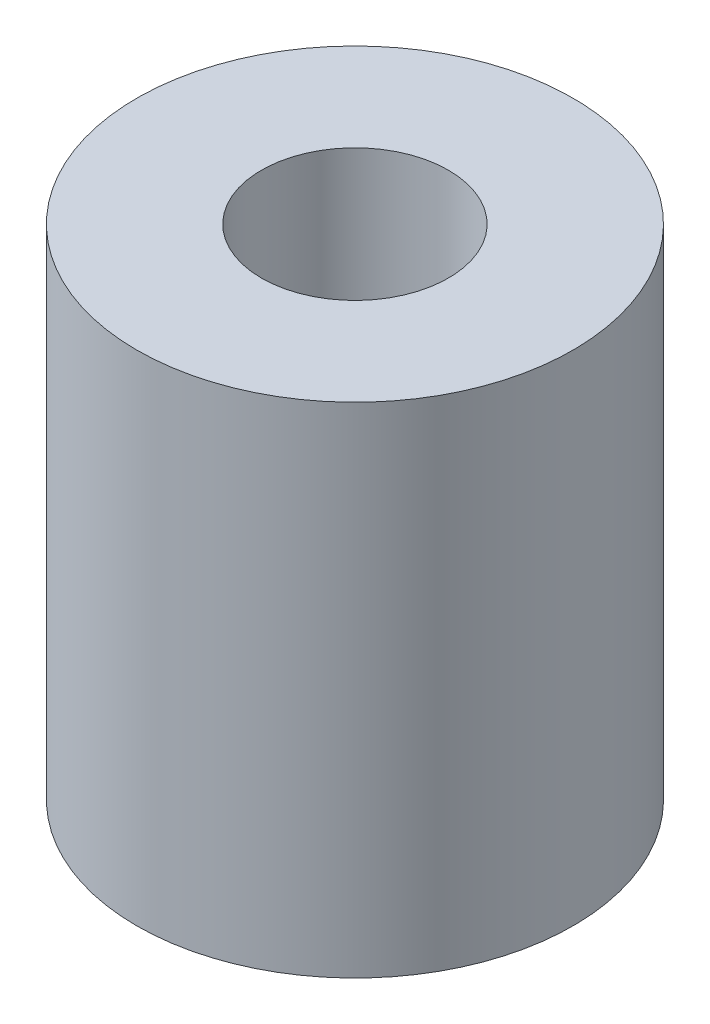
ISO-10303-21;
HEADER;
FILE_DESCRIPTION(('STEP AP214'),'2;1');
FILE_NAME('part.step','',(''),(''),'','','');
FILE_SCHEMA(('AUTOMOTIVE_DESIGN { 1 0 10303 214 1 1 1 1 }'));
ENDSEC;
DATA;
#1=APPLICATION_CONTEXT('core data for automotive mechanical design processes');
#2=APPLICATION_PROTOCOL_DEFINITION('international standard','automotive_design',2000,#1);
#3=PRODUCT_CONTEXT('',#1,'mechanical');
#4=PRODUCT('Part','Part','',(#3));
#5=PRODUCT_RELATED_PRODUCT_CATEGORY('part','',(#4));
#6=PRODUCT_DEFINITION_FORMATION('','',#4);
#7=PRODUCT_DEFINITION_CONTEXT('part definition',#1,'design');
#8=PRODUCT_DEFINITION('design','',#6,#7);
#9=PRODUCT_DEFINITION_SHAPE('','',#8);
#10=(LENGTH_UNIT() NAMED_UNIT(*) SI_UNIT(.MILLI.,.METRE.));
#11=(NAMED_UNIT(*) PLANE_ANGLE_UNIT() SI_UNIT($,.RADIAN.));
#12=(NAMED_UNIT(*) SI_UNIT($,.STERADIAN.) SOLID_ANGLE_UNIT());
#13=UNCERTAINTY_MEASURE_WITH_UNIT(LENGTH_MEASURE(1.E-05),#10,'distance_accuracy_value','');
#14=(GEOMETRIC_REPRESENTATION_CONTEXT(3) GLOBAL_UNCERTAINTY_ASSIGNED_CONTEXT((#13)) GLOBAL_UNIT_ASSIGNED_CONTEXT((#10,
#11,#12)) REPRESENTATION_CONTEXT('',''));
#15=CARTESIAN_POINT('',(0.,0.,0.));
#16=DIRECTION('',(0.,0.,1.));
#17=DIRECTION('',(1.,0.,0.));
#18=AXIS2_PLACEMENT_3D('',#15,#16,#17);
#19=CARTESIAN_POINT('',(0.,8.,0.));
#20=DIRECTION('',(0.,1.,0.));
#21=DIRECTION('',(0.,0.,1.));
#22=AXIS2_PLACEMENT_3D('',#19,#20,#21);
#23=PLANE('',#22);
#24=CARTESIAN_POINT('',(0.,8.,0.));
#25=DIRECTION('',(0.,1.,0.));
#26=DIRECTION('',(0.,0.,1.));
#27=AXIS2_PLACEMENT_3D('',#24,#25,#26);
#28=CIRCLE('',#27,3.5);
#29=CARTESIAN_POINT('',(0.,8.,3.5));
#30=VERTEX_POINT('',#29);
#31=EDGE_CURVE('E10',#30,#30,#28,.T.);
#32=ORIENTED_EDGE('',*,*,#31,.T.);
#33=EDGE_LOOP('',(#32));
#34=FACE_BOUND('',#33,.T.);
#35=CARTESIAN_POINT('',(0.,8.,0.));
#36=DIRECTION('',(0.,1.,0.));
#37=DIRECTION('',(0.,0.,1.));
#38=AXIS2_PLACEMENT_3D('',#35,#36,#37);
#39=CIRCLE('',#38,1.5);
#40=CARTESIAN_POINT('',(0.,8.,1.5));
#41=VERTEX_POINT('',#40);
#42=EDGE_CURVE('E44',#41,#41,#39,.T.);
#43=ORIENTED_EDGE('',*,*,#42,.F.);
#44=EDGE_LOOP('',(#43));
#45=FACE_BOUND('',#44,.T.);
#46=ADVANCED_FACE('F33',(#34,#45),#23,.T.);
#47=CARTESIAN_POINT('',(0.,0.,0.));
#48=DIRECTION('',(0.,1.,0.));
#49=DIRECTION('',(0.,0.,1.));
#50=AXIS2_PLACEMENT_3D('',#47,#48,#49);
#51=PLANE('',#50);
#52=CARTESIAN_POINT('',(0.,0.,0.));
#53=DIRECTION('',(0.,1.,0.));
#54=DIRECTION('',(0.,0.,1.));
#55=AXIS2_PLACEMENT_3D('',#52,#53,#54);
#56=CIRCLE('',#55,3.5);
#57=CARTESIAN_POINT('',(0.,0.,3.5));
#58=VERTEX_POINT('',#57);
#59=EDGE_CURVE('E37',#58,#58,#56,.T.);
#60=ORIENTED_EDGE('',*,*,#59,.F.);
#61=EDGE_LOOP('',(#60));
#62=FACE_BOUND('',#61,.T.);
#63=CARTESIAN_POINT('',(0.,0.,0.));
#64=DIRECTION('',(0.,1.,0.));
#65=DIRECTION('',(0.,0.,1.));
#66=AXIS2_PLACEMENT_3D('',#63,#64,#65);
#67=CIRCLE('',#66,1.5);
#68=CARTESIAN_POINT('',(0.,0.,1.5));
#69=VERTEX_POINT('',#68);
#70=EDGE_CURVE('E46',#69,#69,#67,.T.);
#71=ORIENTED_EDGE('',*,*,#70,.T.);
#72=EDGE_LOOP('',(#71));
#73=FACE_BOUND('',#72,.T.);
#74=ADVANCED_FACE('F56',(#62,#73),#51,.F.);
#75=CARTESIAN_POINT('',(0.,8.,0.));
#76=DIRECTION('',(0.,-1.,0.));
#77=DIRECTION('',(0.,0.,-1.));
#78=AXIS2_PLACEMENT_3D('',#75,#76,#77);
#79=CYLINDRICAL_SURFACE('',#78,3.5);
#80=ORIENTED_EDGE('',*,*,#31,.F.);
#81=EDGE_LOOP('',(#80));
#82=FACE_BOUND('',#81,.T.);
#83=ORIENTED_EDGE('',*,*,#59,.T.);
#84=EDGE_LOOP('',(#83));
#85=FACE_BOUND('',#84,.T.);
#86=ADVANCED_FACE('F35',(#82,#85),#79,.T.);
#87=CARTESIAN_POINT('',(0.,8.,0.));
#88=DIRECTION('',(0.,-1.,0.));
#89=DIRECTION('',(0.,0.,-1.));
#90=AXIS2_PLACEMENT_3D('',#87,#88,#89);
#91=CYLINDRICAL_SURFACE('',#90,1.5);
#92=ORIENTED_EDGE('',*,*,#42,.T.);
#93=EDGE_LOOP('',(#92));
#94=FACE_BOUND('',#93,.T.);
#95=ORIENTED_EDGE('',*,*,#70,.F.);
#96=EDGE_LOOP('',(#95));
#97=FACE_BOUND('',#96,.T.);
#98=ADVANCED_FACE('F52',(#94,#97),#91,.F.);
#99=CLOSED_SHELL('',(#46,#74,#86,#98));
#100=MANIFOLD_SOLID_BREP('B2',#99);
#101=ADVANCED_BREP_SHAPE_REPRESENTATION('',(#18,#100),#14);
#102=SHAPE_DEFINITION_REPRESENTATION(#9,#101);
ENDSEC;
END-ISO-10303-21;
